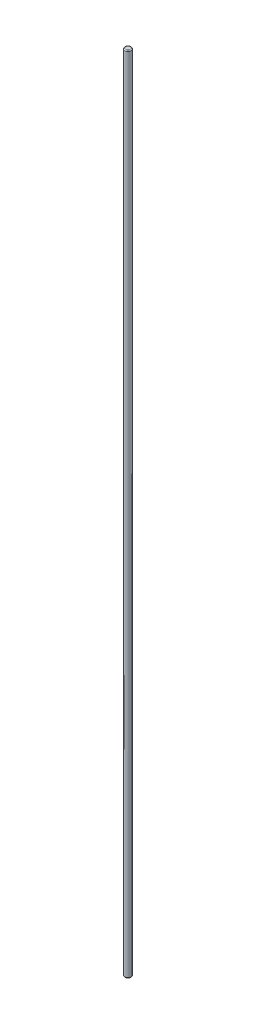
ISO-10303-21;
HEADER;
FILE_DESCRIPTION(('STEP AP214'),'2;1');
FILE_NAME('part.step','',(''),(''),'','','');
FILE_SCHEMA(('AUTOMOTIVE_DESIGN { 1 0 10303 214 1 1 1 1 }'));
ENDSEC;
DATA;
#1=APPLICATION_CONTEXT('core data for automotive mechanical design processes');
#2=APPLICATION_PROTOCOL_DEFINITION('international standard','automotive_design',2000,#1);
#3=PRODUCT_CONTEXT('',#1,'mechanical');
#4=PRODUCT('Part','Part','',(#3));
#5=PRODUCT_RELATED_PRODUCT_CATEGORY('part','',(#4));
#6=PRODUCT_DEFINITION_FORMATION('','',#4);
#7=PRODUCT_DEFINITION_CONTEXT('part definition',#1,'design');
#8=PRODUCT_DEFINITION('design','',#6,#7);
#9=PRODUCT_DEFINITION_SHAPE('','',#8);
#10=(LENGTH_UNIT() NAMED_UNIT(*) SI_UNIT(.MILLI.,.METRE.));
#11=(NAMED_UNIT(*) PLANE_ANGLE_UNIT() SI_UNIT($,.RADIAN.));
#12=(NAMED_UNIT(*) SI_UNIT($,.STERADIAN.) SOLID_ANGLE_UNIT());
#13=UNCERTAINTY_MEASURE_WITH_UNIT(LENGTH_MEASURE(1.E-05),#10,'distance_accuracy_value','');
#14=(GEOMETRIC_REPRESENTATION_CONTEXT(3) GLOBAL_UNCERTAINTY_ASSIGNED_CONTEXT((#13)) GLOBAL_UNIT_ASSIGNED_CONTEXT((#10,
#11,#12)) REPRESENTATION_CONTEXT('',''));
#15=CARTESIAN_POINT('',(0.,0.,0.));
#16=DIRECTION('',(0.,0.,1.));
#17=DIRECTION('',(1.,0.,0.));
#18=AXIS2_PLACEMENT_3D('',#15,#16,#17);
#19=CARTESIAN_POINT('',(0.,2850.,0.));
#20=DIRECTION('',(0.,-1.,0.));
#21=DIRECTION('',(0.,0.,-1.));
#22=AXIS2_PLACEMENT_3D('',#19,#20,#21);
#23=CYLINDRICAL_SURFACE('',#22,11.25);
#24=CARTESIAN_POINT('',(0.,3.00000000000011,0.));
#25=DIRECTION('',(0.,1.,0.));
#26=DIRECTION('',(0.,0.,1.));
#27=AXIS2_PLACEMENT_3D('',#24,#25,#26);
#28=CIRCLE('',#27,11.25);
#29=CARTESIAN_POINT('',(0.,3.00000000000011,11.25));
#30=VERTEX_POINT('',#29);
#31=EDGE_CURVE('E42',#30,#30,#28,.T.);
#32=ORIENTED_EDGE('',*,*,#31,.T.);
#33=EDGE_LOOP('',(#32));
#34=FACE_BOUND('',#33,.T.);
#35=CARTESIAN_POINT('',(0.,2847.,0.));
#36=DIRECTION('',(0.,1.,0.));
#37=DIRECTION('',(0.,0.,1.));
#38=AXIS2_PLACEMENT_3D('',#35,#36,#37);
#39=CIRCLE('',#38,11.25);
#40=CARTESIAN_POINT('',(0.,2847.,11.25));
#41=VERTEX_POINT('',#40);
#42=EDGE_CURVE('E46',#41,#41,#39,.F.);
#43=ORIENTED_EDGE('',*,*,#42,.T.);
#44=EDGE_LOOP('',(#43));
#45=FACE_BOUND('',#44,.T.);
#46=ADVANCED_FACE('F31',(#34,#45),#23,.T.);
#47=CARTESIAN_POINT('',(0.,2850.,0.));
#48=DIRECTION('',(0.,1.,0.));
#49=DIRECTION('',(0.,0.,1.));
#50=AXIS2_PLACEMENT_3D('',#47,#48,#49);
#51=PLANE('',#50);
#52=CARTESIAN_POINT('',(0.,2850.,0.));
#53=DIRECTION('',(0.,1.,0.));
#54=DIRECTION('',(0.,0.,1.));
#55=AXIS2_PLACEMENT_3D('',#52,#53,#54);
#56=CIRCLE('',#55,8.25);
#57=CARTESIAN_POINT('',(0.,2850.,8.25));
#58=VERTEX_POINT('',#57);
#59=EDGE_CURVE('E10',#58,#58,#56,.T.);
#60=ORIENTED_EDGE('',*,*,#59,.T.);
#61=EDGE_LOOP('',(#60));
#62=FACE_BOUND('',#61,.T.);
#63=ADVANCED_FACE('F62',(#62),#51,.T.);
#64=CARTESIAN_POINT('',(0.,0.,0.));
#65=DIRECTION('',(0.,1.,0.));
#66=DIRECTION('',(0.,0.,1.));
#67=AXIS2_PLACEMENT_3D('',#64,#65,#66);
#68=PLANE('',#67);
#69=CARTESIAN_POINT('',(0.,0.,0.));
#70=DIRECTION('',(0.,1.,0.));
#71=DIRECTION('',(0.,0.,1.));
#72=AXIS2_PLACEMENT_3D('',#69,#70,#71);
#73=CIRCLE('',#72,8.25);
#74=CARTESIAN_POINT('',(0.,0.,8.25));
#75=VERTEX_POINT('',#74);
#76=EDGE_CURVE('E38',#75,#75,#73,.F.);
#77=ORIENTED_EDGE('',*,*,#76,.T.);
#78=EDGE_LOOP('',(#77));
#79=FACE_BOUND('',#78,.T.);
#80=ADVANCED_FACE('F59',(#79),#68,.F.);
#81=CARTESIAN_POINT('',(0.,3.00000000000011,0.));
#82=DIRECTION('',(0.,1.,0.));
#83=DIRECTION('',(0.,0.,1.));
#84=AXIS2_PLACEMENT_3D('',#81,#82,#83);
#85=TOROIDAL_SURFACE('',#84,8.25,3.);
#86=ORIENTED_EDGE('',*,*,#76,.F.);
#87=EDGE_LOOP('',(#86));
#88=FACE_BOUND('',#87,.T.);
#89=ORIENTED_EDGE('',*,*,#31,.F.);
#90=EDGE_LOOP('',(#89));
#91=FACE_BOUND('',#90,.T.);
#92=ADVANCED_FACE('F55',(#88,#91),#85,.T.);
#93=CARTESIAN_POINT('',(0.,2847.,0.));
#94=DIRECTION('',(0.,1.,0.));
#95=DIRECTION('',(0.,0.,1.));
#96=AXIS2_PLACEMENT_3D('',#93,#94,#95);
#97=TOROIDAL_SURFACE('',#96,8.25,3.);
#98=ORIENTED_EDGE('',*,*,#42,.F.);
#99=EDGE_LOOP('',(#98));
#100=FACE_BOUND('',#99,.T.);
#101=ORIENTED_EDGE('',*,*,#59,.F.);
#102=EDGE_LOOP('',(#101));
#103=FACE_BOUND('',#102,.T.);
#104=ADVANCED_FACE('F33',(#100,#103),#97,.T.);
#105=CLOSED_SHELL('',(#46,#63,#80,#92,#104));
#106=MANIFOLD_SOLID_BREP('B2',#105);
#107=ADVANCED_BREP_SHAPE_REPRESENTATION('',(#18,#106),#14);
#108=SHAPE_DEFINITION_REPRESENTATION(#9,#107);
ENDSEC;
END-ISO-10303-21;
